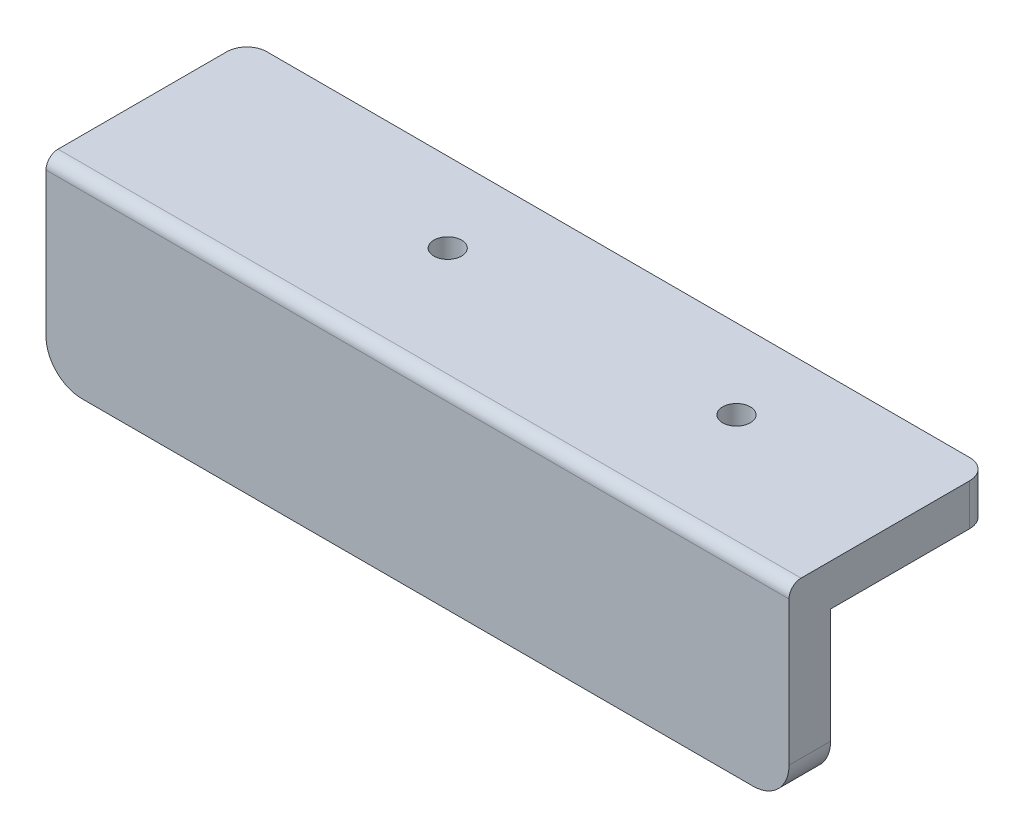
ISO-10303-21;
HEADER;
FILE_DESCRIPTION(('STEP AP214'),'2;1');
FILE_NAME('part.step','',(''),(''),'','','');
FILE_SCHEMA(('AUTOMOTIVE_DESIGN { 1 0 10303 214 1 1 1 1 }'));
ENDSEC;
DATA;
#1=APPLICATION_CONTEXT('core data for automotive mechanical design processes');
#2=APPLICATION_PROTOCOL_DEFINITION('international standard','automotive_design',2000,#1);
#3=PRODUCT_CONTEXT('',#1,'mechanical');
#4=PRODUCT('Part','Part','',(#3));
#5=PRODUCT_RELATED_PRODUCT_CATEGORY('part','',(#4));
#6=PRODUCT_DEFINITION_FORMATION('','',#4);
#7=PRODUCT_DEFINITION_CONTEXT('part definition',#1,'design');
#8=PRODUCT_DEFINITION('design','',#6,#7);
#9=PRODUCT_DEFINITION_SHAPE('','',#8);
#10=(LENGTH_UNIT() NAMED_UNIT(*) SI_UNIT(.MILLI.,.METRE.));
#11=(NAMED_UNIT(*) PLANE_ANGLE_UNIT() SI_UNIT($,.RADIAN.));
#12=(NAMED_UNIT(*) SI_UNIT($,.STERADIAN.) SOLID_ANGLE_UNIT());
#13=UNCERTAINTY_MEASURE_WITH_UNIT(LENGTH_MEASURE(1.E-05),#10,'distance_accuracy_value','');
#14=(GEOMETRIC_REPRESENTATION_CONTEXT(3) GLOBAL_UNCERTAINTY_ASSIGNED_CONTEXT((#13)) GLOBAL_UNIT_ASSIGNED_CONTEXT((#10,
#11,#12)) REPRESENTATION_CONTEXT('',''));
#15=CARTESIAN_POINT('',(0.,0.,0.));
#16=DIRECTION('',(0.,0.,1.));
#17=DIRECTION('',(1.,0.,0.));
#18=AXIS2_PLACEMENT_3D('',#15,#16,#17);
#19=CARTESIAN_POINT('',(44.45,-9.525,-20.2311));
#20=DIRECTION('',(0.,1.,0.));
#21=DIRECTION('',(0.,0.,1.));
#22=AXIS2_PLACEMENT_3D('',#19,#20,#21);
#23=CYLINDRICAL_SURFACE('',#22,2.54);
#24=DIRECTION('',(0.,1.,0.));
#25=VECTOR('',#24,1.);
#26=CARTESIAN_POINT('',(46.99,-9.525,-20.2311));
#27=LINE('',#26,#25);
#28=CARTESIAN_POINT('',(46.99,9.525,-20.2311));
#29=VERTEX_POINT('',#28);
#30=CARTESIAN_POINT('',(46.99,14.7828,-20.2311));
#31=VERTEX_POINT('',#30);
#32=EDGE_CURVE('E202',#29,#31,#27,.T.);
#33=ORIENTED_EDGE('',*,*,#32,.F.);
#34=CARTESIAN_POINT('',(44.45,9.525,-20.2311));
#35=DIRECTION('',(0.,-1.,0.));
#36=DIRECTION('',(0.,0.,-1.));
#37=AXIS2_PLACEMENT_3D('',#34,#35,#36);
#38=CIRCLE('',#37,2.54);
#39=CARTESIAN_POINT('',(44.45,9.525,-22.7711));
#40=VERTEX_POINT('',#39);
#41=EDGE_CURVE('E53',#40,#29,#38,.T.);
#42=ORIENTED_EDGE('',*,*,#41,.F.);
#43=DIRECTION('',(0.,1.,0.));
#44=VECTOR('',#43,1.);
#45=CARTESIAN_POINT('',(44.45,14.7828,-22.7711));
#46=LINE('',#45,#44);
#47=CARTESIAN_POINT('',(44.45,14.7828,-22.7711));
#48=VERTEX_POINT('',#47);
#49=EDGE_CURVE('E205',#48,#40,#46,.F.);
#50=ORIENTED_EDGE('',*,*,#49,.F.);
#51=CARTESIAN_POINT('',(44.45,14.7828,-20.2311));
#52=DIRECTION('',(0.,-1.,0.));
#53=DIRECTION('',(0.,0.,-1.));
#54=AXIS2_PLACEMENT_3D('',#51,#52,#53);
#55=CIRCLE('',#54,2.54);
#56=EDGE_CURVE('E13',#31,#48,#55,.F.);
#57=ORIENTED_EDGE('',*,*,#56,.F.);
#58=EDGE_LOOP('',(#33,#42,#50,#57));
#59=FACE_BOUND('',#58,.T.);
#60=ADVANCED_FACE('F45',(#59),#23,.T.);
#61=CARTESIAN_POINT('',(-44.45,-9.525,-20.2311));
#62=DIRECTION('',(0.,-1.,0.));
#63=DIRECTION('',(0.,0.,-1.));
#64=AXIS2_PLACEMENT_3D('',#61,#62,#63);
#65=CYLINDRICAL_SURFACE('',#64,2.54);
#66=DIRECTION('',(0.,-1.,0.));
#67=VECTOR('',#66,1.);
#68=CARTESIAN_POINT('',(-46.99,-9.525,-20.2311));
#69=LINE('',#68,#67);
#70=CARTESIAN_POINT('',(-46.99,14.7828,-20.2311));
#71=VERTEX_POINT('',#70);
#72=CARTESIAN_POINT('',(-46.99,9.525,-20.2311));
#73=VERTEX_POINT('',#72);
#74=EDGE_CURVE('E134',#71,#73,#69,.T.);
#75=ORIENTED_EDGE('',*,*,#74,.F.);
#76=CARTESIAN_POINT('',(-44.45,14.7828,-20.2311));
#77=DIRECTION('',(0.,-1.,0.));
#78=DIRECTION('',(0.,0.,-1.));
#79=AXIS2_PLACEMENT_3D('',#76,#77,#78);
#80=CIRCLE('',#79,2.54);
#81=CARTESIAN_POINT('',(-44.45,14.7828,-22.7711));
#82=VERTEX_POINT('',#81);
#83=EDGE_CURVE('E198',#82,#71,#80,.F.);
#84=ORIENTED_EDGE('',*,*,#83,.F.);
#85=DIRECTION('',(0.,-1.,0.));
#86=VECTOR('',#85,1.);
#87=CARTESIAN_POINT('',(-44.45,14.7828,-22.7711));
#88=LINE('',#87,#86);
#89=CARTESIAN_POINT('',(-44.45,9.525,-22.7711));
#90=VERTEX_POINT('',#89);
#91=EDGE_CURVE('E195',#90,#82,#88,.F.);
#92=ORIENTED_EDGE('',*,*,#91,.F.);
#93=CARTESIAN_POINT('',(-44.45,9.525,-20.2311));
#94=DIRECTION('',(0.,-1.,0.));
#95=DIRECTION('',(0.,0.,-1.));
#96=AXIS2_PLACEMENT_3D('',#93,#94,#95);
#97=CIRCLE('',#96,2.54);
#98=EDGE_CURVE('E200',#73,#90,#97,.T.);
#99=ORIENTED_EDGE('',*,*,#98,.F.);
#100=EDGE_LOOP('',(#75,#84,#92,#99));
#101=FACE_BOUND('',#100,.T.);
#102=ADVANCED_FACE('F230',(#101),#65,.T.);
#103=CARTESIAN_POINT('',(-46.99,13.2588,1.1049));
#104=DIRECTION('',(1.,0.,0.));
#105=DIRECTION('',(0.,0.,-1.));
#106=AXIS2_PLACEMENT_3D('',#103,#104,#105);
#107=CYLINDRICAL_SURFACE('',#106,1.524);
#108=DIRECTION('',(1.,0.,0.));
#109=VECTOR('',#108,1.);
#110=CARTESIAN_POINT('',(-46.99,14.7828,1.1049));
#111=LINE('',#110,#109);
#112=CARTESIAN_POINT('',(-46.99,14.7828,1.1049));
#113=VERTEX_POINT('',#112);
#114=CARTESIAN_POINT('',(46.99,14.7828,1.1049));
#115=VERTEX_POINT('',#114);
#116=EDGE_CURVE('E253',#113,#115,#111,.T.);
#117=ORIENTED_EDGE('',*,*,#116,.F.);
#118=CARTESIAN_POINT('',(-46.99,13.2588,1.1049));
#119=DIRECTION('',(1.,0.,0.));
#120=DIRECTION('',(0.,0.,-1.));
#121=AXIS2_PLACEMENT_3D('',#118,#119,#120);
#122=CIRCLE('',#121,1.524);
#123=CARTESIAN_POINT('',(-46.99,13.2588,2.6289));
#124=VERTEX_POINT('',#123);
#125=EDGE_CURVE('E256',#124,#113,#122,.F.);
#126=ORIENTED_EDGE('',*,*,#125,.F.);
#127=DIRECTION('',(1.,0.,0.));
#128=VECTOR('',#127,1.);
#129=CARTESIAN_POINT('',(46.99,13.2588,2.6289));
#130=LINE('',#129,#128);
#131=CARTESIAN_POINT('',(46.99,13.2588,2.6289));
#132=VERTEX_POINT('',#131);
#133=EDGE_CURVE('E255',#132,#124,#130,.F.);
#134=ORIENTED_EDGE('',*,*,#133,.F.);
#135=CARTESIAN_POINT('',(46.99,13.2588,1.1049));
#136=DIRECTION('',(-1.,0.,0.));
#137=DIRECTION('',(0.,0.,1.));
#138=AXIS2_PLACEMENT_3D('',#135,#136,#137);
#139=CIRCLE('',#138,1.524);
#140=EDGE_CURVE('E192',#115,#132,#139,.F.);
#141=ORIENTED_EDGE('',*,*,#140,.F.);
#142=EDGE_LOOP('',(#117,#126,#134,#141));
#143=FACE_BOUND('',#142,.T.);
#144=ADVANCED_FACE('F262',(#143),#107,.T.);
#145=CARTESIAN_POINT('',(42.418,-4.953,2.6289));
#146=DIRECTION('',(0.,0.,1.));
#147=DIRECTION('',(1.,0.,0.));
#148=AXIS2_PLACEMENT_3D('',#145,#146,#147);
#149=CYLINDRICAL_SURFACE('',#148,4.572);
#150=DIRECTION('',(0.,0.,1.));
#151=VECTOR('',#150,1.);
#152=CARTESIAN_POINT('',(42.418,-9.525,2.6289));
#153=LINE('',#152,#151);
#154=CARTESIAN_POINT('',(42.418,-9.525,-2.6289));
#155=VERTEX_POINT('',#154);
#156=CARTESIAN_POINT('',(42.418,-9.525,2.6289));
#157=VERTEX_POINT('',#156);
#158=EDGE_CURVE('E242',#155,#157,#153,.T.);
#159=ORIENTED_EDGE('',*,*,#158,.F.);
#160=CARTESIAN_POINT('',(42.418,-4.953,-2.6289));
#161=DIRECTION('',(0.,0.,-1.));
#162=DIRECTION('',(-1.,0.,0.));
#163=AXIS2_PLACEMENT_3D('',#160,#161,#162);
#164=CIRCLE('',#163,4.572);
#165=CARTESIAN_POINT('',(46.99,-4.953,-2.6289));
#166=VERTEX_POINT('',#165);
#167=EDGE_CURVE('E237',#166,#155,#164,.T.);
#168=ORIENTED_EDGE('',*,*,#167,.F.);
#169=DIRECTION('',(0.,0.,1.));
#170=VECTOR('',#169,1.);
#171=CARTESIAN_POINT('',(46.99,-4.953,2.6289));
#172=LINE('',#171,#170);
#173=CARTESIAN_POINT('',(46.99,-4.953,2.6289));
#174=VERTEX_POINT('',#173);
#175=EDGE_CURVE('E236',#174,#166,#172,.F.);
#176=ORIENTED_EDGE('',*,*,#175,.F.);
#177=CARTESIAN_POINT('',(42.418,-4.953,2.6289));
#178=DIRECTION('',(0.,0.,-1.));
#179=DIRECTION('',(-1.,0.,0.));
#180=AXIS2_PLACEMENT_3D('',#177,#178,#179);
#181=CIRCLE('',#180,4.572);
#182=EDGE_CURVE('E240',#157,#174,#181,.F.);
#183=ORIENTED_EDGE('',*,*,#182,.F.);
#184=EDGE_LOOP('',(#159,#168,#176,#183));
#185=FACE_BOUND('',#184,.T.);
#186=ADVANCED_FACE('F243',(#185),#149,.T.);
#187=CARTESIAN_POINT('',(-42.418,-4.953,2.6289));
#188=DIRECTION('',(0.,0.,-1.));
#189=DIRECTION('',(-1.,0.,0.));
#190=AXIS2_PLACEMENT_3D('',#187,#188,#189);
#191=CYLINDRICAL_SURFACE('',#190,4.572);
#192=DIRECTION('',(0.,0.,-1.));
#193=VECTOR('',#192,1.);
#194=CARTESIAN_POINT('',(-42.418,-9.525,2.6289));
#195=LINE('',#194,#193);
#196=CARTESIAN_POINT('',(-42.418,-9.525,2.6289));
#197=VERTEX_POINT('',#196);
#198=CARTESIAN_POINT('',(-42.418,-9.525,-2.6289));
#199=VERTEX_POINT('',#198);
#200=EDGE_CURVE('E267',#197,#199,#195,.T.);
#201=ORIENTED_EDGE('',*,*,#200,.F.);
#202=CARTESIAN_POINT('',(-42.418,-4.953,2.6289));
#203=DIRECTION('',(0.,0.,-1.));
#204=DIRECTION('',(-1.,0.,0.));
#205=AXIS2_PLACEMENT_3D('',#202,#203,#204);
#206=CIRCLE('',#205,4.572);
#207=CARTESIAN_POINT('',(-46.99,-4.953,2.6289));
#208=VERTEX_POINT('',#207);
#209=EDGE_CURVE('E248',#208,#197,#206,.F.);
#210=ORIENTED_EDGE('',*,*,#209,.F.);
#211=DIRECTION('',(0.,0.,-1.));
#212=VECTOR('',#211,1.);
#213=CARTESIAN_POINT('',(-46.99,-4.953,2.6289));
#214=LINE('',#213,#212);
#215=CARTESIAN_POINT('',(-46.99,-4.953,-2.6289));
#216=VERTEX_POINT('',#215);
#217=EDGE_CURVE('E265',#216,#208,#214,.F.);
#218=ORIENTED_EDGE('',*,*,#217,.F.);
#219=CARTESIAN_POINT('',(-42.418,-4.953,-2.6289));
#220=DIRECTION('',(0.,0.,-1.));
#221=DIRECTION('',(-1.,0.,0.));
#222=AXIS2_PLACEMENT_3D('',#219,#220,#221);
#223=CIRCLE('',#222,4.572);
#224=EDGE_CURVE('E148',#199,#216,#223,.T.);
#225=ORIENTED_EDGE('',*,*,#224,.F.);
#226=EDGE_LOOP('',(#201,#210,#218,#225));
#227=FACE_BOUND('',#226,.T.);
#228=ADVANCED_FACE('F291',(#227),#191,.T.);
#229=CARTESIAN_POINT('',(46.99,-9.525,2.6289));
#230=DIRECTION('',(-1.,0.,0.));
#231=DIRECTION('',(0.,0.,1.));
#232=AXIS2_PLACEMENT_3D('',#229,#230,#231);
#233=PLANE('',#232);
#234=DIRECTION('',(0.,0.,-1.));
#235=VECTOR('',#234,1.);
#236=CARTESIAN_POINT('',(46.99,9.525,2.6289));
#237=LINE('',#236,#235);
#238=CARTESIAN_POINT('',(46.99,9.525,-2.6289));
#239=VERTEX_POINT('',#238);
#240=EDGE_CURVE('E138',#239,#29,#237,.T.);
#241=ORIENTED_EDGE('',*,*,#240,.T.);
#242=ORIENTED_EDGE('',*,*,#32,.T.);
#243=DIRECTION('',(0.,0.,-1.));
#244=VECTOR('',#243,1.);
#245=CARTESIAN_POINT('',(46.99,14.7828,2.6289));
#246=LINE('',#245,#244);
#247=EDGE_CURVE('E221',#115,#31,#246,.T.);
#248=ORIENTED_EDGE('',*,*,#247,.F.);
#249=ORIENTED_EDGE('',*,*,#140,.T.);
#250=DIRECTION('',(0.,1.,0.));
#251=VECTOR('',#250,1.);
#252=CARTESIAN_POINT('',(46.99,-9.525,2.6289));
#253=LINE('',#252,#251);
#254=EDGE_CURVE('E171',#174,#132,#253,.T.);
#255=ORIENTED_EDGE('',*,*,#254,.F.);
#256=ORIENTED_EDGE('',*,*,#175,.T.);
#257=DIRECTION('',(0.,1.,0.));
#258=VECTOR('',#257,1.);
#259=CARTESIAN_POINT('',(46.99,-9.525,-2.6289));
#260=LINE('',#259,#258);
#261=EDGE_CURVE('E155',#166,#239,#260,.T.);
#262=ORIENTED_EDGE('',*,*,#261,.T.);
#263=EDGE_LOOP('',(#241,#242,#248,#249,#255,#256,#262));
#264=FACE_BOUND('',#263,.T.);
#265=ADVANCED_FACE('F233',(#264),#233,.F.);
#266=CARTESIAN_POINT('',(-46.99,-9.525,2.6289));
#267=DIRECTION('',(1.,0.,0.));
#268=DIRECTION('',(0.,0.,-1.));
#269=AXIS2_PLACEMENT_3D('',#266,#267,#268);
#270=PLANE('',#269);
#271=DIRECTION('',(0.,0.,1.));
#272=VECTOR('',#271,1.);
#273=CARTESIAN_POINT('',(-46.99,14.7828,2.6289));
#274=LINE('',#273,#272);
#275=EDGE_CURVE('E220',#71,#113,#274,.T.);
#276=ORIENTED_EDGE('',*,*,#275,.F.);
#277=ORIENTED_EDGE('',*,*,#74,.T.);
#278=DIRECTION('',(0.,0.,1.));
#279=VECTOR('',#278,1.);
#280=CARTESIAN_POINT('',(-46.99,9.525,2.6289));
#281=LINE('',#280,#279);
#282=CARTESIAN_POINT('',(-46.99,9.525,-2.6289));
#283=VERTEX_POINT('',#282);
#284=EDGE_CURVE('E127',#73,#283,#281,.T.);
#285=ORIENTED_EDGE('',*,*,#284,.T.);
#286=DIRECTION('',(0.,-1.,0.));
#287=VECTOR('',#286,1.);
#288=CARTESIAN_POINT('',(-46.99,-9.525,-2.6289));
#289=LINE('',#288,#287);
#290=EDGE_CURVE('E132',#283,#216,#289,.T.);
#291=ORIENTED_EDGE('',*,*,#290,.T.);
#292=ORIENTED_EDGE('',*,*,#217,.T.);
#293=DIRECTION('',(0.,-1.,0.));
#294=VECTOR('',#293,1.);
#295=CARTESIAN_POINT('',(-46.99,-9.525,2.6289));
#296=LINE('',#295,#294);
#297=EDGE_CURVE('E176',#124,#208,#296,.T.);
#298=ORIENTED_EDGE('',*,*,#297,.F.);
#299=ORIENTED_EDGE('',*,*,#125,.T.);
#300=EDGE_LOOP('',(#276,#277,#285,#291,#292,#298,#299));
#301=FACE_BOUND('',#300,.T.);
#302=ADVANCED_FACE('F130',(#301),#270,.F.);
#303=CARTESIAN_POINT('',(-46.99,-9.525,2.6289));
#304=DIRECTION('',(0.,1.,0.));
#305=DIRECTION('',(0.,0.,1.));
#306=AXIS2_PLACEMENT_3D('',#303,#304,#305);
#307=PLANE('',#306);
#308=DIRECTION('',(1.,0.,0.));
#309=VECTOR('',#308,1.);
#310=CARTESIAN_POINT('',(-46.99,-9.525,-2.6289));
#311=LINE('',#310,#309);
#312=EDGE_CURVE('E150',#199,#155,#311,.T.);
#313=ORIENTED_EDGE('',*,*,#312,.T.);
#314=ORIENTED_EDGE('',*,*,#158,.T.);
#315=DIRECTION('',(1.,0.,0.));
#316=VECTOR('',#315,1.);
#317=CARTESIAN_POINT('',(-46.99,-9.525,2.6289));
#318=LINE('',#317,#316);
#319=EDGE_CURVE('E168',#197,#157,#318,.T.);
#320=ORIENTED_EDGE('',*,*,#319,.F.);
#321=ORIENTED_EDGE('',*,*,#200,.T.);
#322=EDGE_LOOP('',(#313,#314,#320,#321));
#323=FACE_BOUND('',#322,.T.);
#324=ADVANCED_FACE('F270',(#323),#307,.F.);
#325=CARTESIAN_POINT('',(46.99,9.525,2.6289));
#326=DIRECTION('',(0.,0.,-1.));
#327=DIRECTION('',(-1.,0.,0.));
#328=AXIS2_PLACEMENT_3D('',#325,#326,#327);
#329=PLANE('',#328);
#330=ORIENTED_EDGE('',*,*,#254,.T.);
#331=ORIENTED_EDGE('',*,*,#133,.T.);
#332=ORIENTED_EDGE('',*,*,#297,.T.);
#333=ORIENTED_EDGE('',*,*,#209,.T.);
#334=ORIENTED_EDGE('',*,*,#319,.T.);
#335=ORIENTED_EDGE('',*,*,#182,.T.);
#336=EDGE_LOOP('',(#330,#331,#332,#333,#334,#335));
#337=FACE_BOUND('',#336,.T.);
#338=ADVANCED_FACE('F263',(#337),#329,.F.);
#339=CARTESIAN_POINT('',(46.99,9.525,-2.6289));
#340=DIRECTION('',(0.,0.,-1.));
#341=DIRECTION('',(-1.,0.,0.));
#342=AXIS2_PLACEMENT_3D('',#339,#340,#341);
#343=PLANE('',#342);
#344=ORIENTED_EDGE('',*,*,#261,.F.);
#345=ORIENTED_EDGE('',*,*,#167,.T.);
#346=ORIENTED_EDGE('',*,*,#312,.F.);
#347=ORIENTED_EDGE('',*,*,#224,.T.);
#348=ORIENTED_EDGE('',*,*,#290,.F.);
#349=DIRECTION('',(-1.,0.,0.));
#350=VECTOR('',#349,1.);
#351=CARTESIAN_POINT('',(-46.99,9.525,-2.6289));
#352=LINE('',#351,#350);
#353=EDGE_CURVE('E145',#239,#283,#352,.T.);
#354=ORIENTED_EDGE('',*,*,#353,.F.);
#355=EDGE_LOOP('',(#344,#345,#346,#347,#348,#354));
#356=FACE_BOUND('',#355,.T.);
#357=ADVANCED_FACE('F144',(#356),#343,.T.);
#358=CARTESIAN_POINT('',(-46.99,14.7828,-22.7711));
#359=DIRECTION('',(0.,0.,1.));
#360=DIRECTION('',(1.,0.,0.));
#361=AXIS2_PLACEMENT_3D('',#358,#359,#360);
#362=PLANE('',#361);
#363=DIRECTION('',(-1.,0.,0.));
#364=VECTOR('',#363,1.);
#365=CARTESIAN_POINT('',(-46.99,14.7828,-22.7711));
#366=LINE('',#365,#364);
#367=EDGE_CURVE('E157',#48,#82,#366,.T.);
#368=ORIENTED_EDGE('',*,*,#367,.F.);
#369=ORIENTED_EDGE('',*,*,#49,.T.);
#370=DIRECTION('',(-1.,0.,0.));
#371=VECTOR('',#370,1.);
#372=CARTESIAN_POINT('',(-46.99,9.525,-22.7711));
#373=LINE('',#372,#371);
#374=EDGE_CURVE('E184',#40,#90,#373,.T.);
#375=ORIENTED_EDGE('',*,*,#374,.T.);
#376=ORIENTED_EDGE('',*,*,#91,.T.);
#377=EDGE_LOOP('',(#368,#369,#375,#376));
#378=FACE_BOUND('',#377,.T.);
#379=ADVANCED_FACE('F231',(#378),#362,.F.);
#380=CARTESIAN_POINT('',(-46.99,14.7828,-22.7711));
#381=DIRECTION('',(0.,-1.,0.));
#382=DIRECTION('',(0.,0.,-1.));
#383=AXIS2_PLACEMENT_3D('',#380,#381,#382);
#384=PLANE('',#383);
#385=CARTESIAN_POINT('',(-11.5062,14.7828,-12.7));
#386=DIRECTION('',(0.,-1.,0.));
#387=DIRECTION('',(0.,0.,-1.));
#388=AXIS2_PLACEMENT_3D('',#385,#386,#387);
#389=CIRCLE('',#388,1.7526);
#390=CARTESIAN_POINT('',(-11.5062,14.7828,-14.4526));
#391=VERTEX_POINT('',#390);
#392=EDGE_CURVE('E209',#391,#391,#389,.T.);
#393=ORIENTED_EDGE('',*,*,#392,.T.);
#394=EDGE_LOOP('',(#393));
#395=FACE_BOUND('',#394,.T.);
#396=CARTESIAN_POINT('',(25.019,14.7828,-12.7));
#397=DIRECTION('',(0.,-1.,0.));
#398=DIRECTION('',(0.,0.,-1.));
#399=AXIS2_PLACEMENT_3D('',#396,#397,#398);
#400=CIRCLE('',#399,1.7526);
#401=CARTESIAN_POINT('',(25.019,14.7828,-14.4526));
#402=VERTEX_POINT('',#401);
#403=EDGE_CURVE('E139',#402,#402,#400,.T.);
#404=ORIENTED_EDGE('',*,*,#403,.T.);
#405=EDGE_LOOP('',(#404));
#406=FACE_BOUND('',#405,.T.);
#407=ORIENTED_EDGE('',*,*,#247,.T.);
#408=ORIENTED_EDGE('',*,*,#56,.T.);
#409=ORIENTED_EDGE('',*,*,#367,.T.);
#410=ORIENTED_EDGE('',*,*,#83,.T.);
#411=ORIENTED_EDGE('',*,*,#275,.T.);
#412=ORIENTED_EDGE('',*,*,#116,.T.);
#413=EDGE_LOOP('',(#407,#408,#409,#410,#411,#412));
#414=FACE_BOUND('',#413,.T.);
#415=ADVANCED_FACE('F226',(#395,#406,#414),#384,.F.);
#416=CARTESIAN_POINT('',(-46.99,9.525,-22.7711));
#417=DIRECTION('',(0.,-1.,0.));
#418=DIRECTION('',(0.,0.,-1.));
#419=AXIS2_PLACEMENT_3D('',#416,#417,#418);
#420=PLANE('',#419);
#421=CARTESIAN_POINT('',(-11.5062,9.525,-12.7));
#422=DIRECTION('',(0.,-1.,0.));
#423=DIRECTION('',(0.,0.,-1.));
#424=AXIS2_PLACEMENT_3D('',#421,#422,#423);
#425=CIRCLE('',#424,1.7526);
#426=CARTESIAN_POINT('',(-11.5062,9.525,-14.4526));
#427=VERTEX_POINT('',#426);
#428=EDGE_CURVE('E48',#427,#427,#425,.T.);
#429=ORIENTED_EDGE('',*,*,#428,.F.);
#430=EDGE_LOOP('',(#429));
#431=FACE_BOUND('',#430,.T.);
#432=CARTESIAN_POINT('',(25.019,9.525,-12.7));
#433=DIRECTION('',(0.,-1.,0.));
#434=DIRECTION('',(0.,0.,-1.));
#435=AXIS2_PLACEMENT_3D('',#432,#433,#434);
#436=CIRCLE('',#435,1.7526);
#437=CARTESIAN_POINT('',(25.019,9.525,-14.4526));
#438=VERTEX_POINT('',#437);
#439=EDGE_CURVE('E207',#438,#438,#436,.T.);
#440=ORIENTED_EDGE('',*,*,#439,.F.);
#441=EDGE_LOOP('',(#440));
#442=FACE_BOUND('',#441,.T.);
#443=ORIENTED_EDGE('',*,*,#374,.F.);
#444=ORIENTED_EDGE('',*,*,#41,.T.);
#445=ORIENTED_EDGE('',*,*,#240,.F.);
#446=ORIENTED_EDGE('',*,*,#353,.T.);
#447=ORIENTED_EDGE('',*,*,#284,.F.);
#448=ORIENTED_EDGE('',*,*,#98,.T.);
#449=EDGE_LOOP('',(#443,#444,#445,#446,#447,#448));
#450=FACE_BOUND('',#449,.T.);
#451=ADVANCED_FACE('F153',(#431,#442,#450),#420,.T.);
#452=CARTESIAN_POINT('',(25.019,67.4543980196864,-12.7));
#453=DIRECTION('',(0.,1.,0.));
#454=DIRECTION('',(-0.725995793369595,0.,0.687699140620121));
#455=AXIS2_PLACEMENT_3D('',#452,#453,#454);
#456=CYLINDRICAL_SURFACE('',#455,1.7526);
#457=ORIENTED_EDGE('',*,*,#439,.T.);
#458=EDGE_LOOP('',(#457));
#459=FACE_BOUND('',#458,.T.);
#460=ORIENTED_EDGE('',*,*,#403,.F.);
#461=EDGE_LOOP('',(#460));
#462=FACE_BOUND('',#461,.T.);
#463=ADVANCED_FACE('F321',(#459,#462),#456,.F.);
#464=CARTESIAN_POINT('',(-11.5062,67.4543980196864,-12.7));
#465=DIRECTION('',(0.,1.,0.));
#466=DIRECTION('',(0.980819416592038,0.,-0.194918629268871));
#467=AXIS2_PLACEMENT_3D('',#464,#465,#466);
#468=CYLINDRICAL_SURFACE('',#467,1.7526);
#469=ORIENTED_EDGE('',*,*,#428,.T.);
#470=EDGE_LOOP('',(#469));
#471=FACE_BOUND('',#470,.T.);
#472=ORIENTED_EDGE('',*,*,#392,.F.);
#473=EDGE_LOOP('',(#472));
#474=FACE_BOUND('',#473,.T.);
#475=ADVANCED_FACE('F327',(#471,#474),#468,.F.);
#476=CLOSED_SHELL('',(#60,#102,#144,#186,#228,#265,#302,#324,#338,#357,#379,#415,#451,#463,#475));
#477=MANIFOLD_SOLID_BREP('B2',#476);
#478=ADVANCED_BREP_SHAPE_REPRESENTATION('',(#18,#477),#14);
#479=SHAPE_DEFINITION_REPRESENTATION(#9,#478);
ENDSEC;
END-ISO-10303-21;
